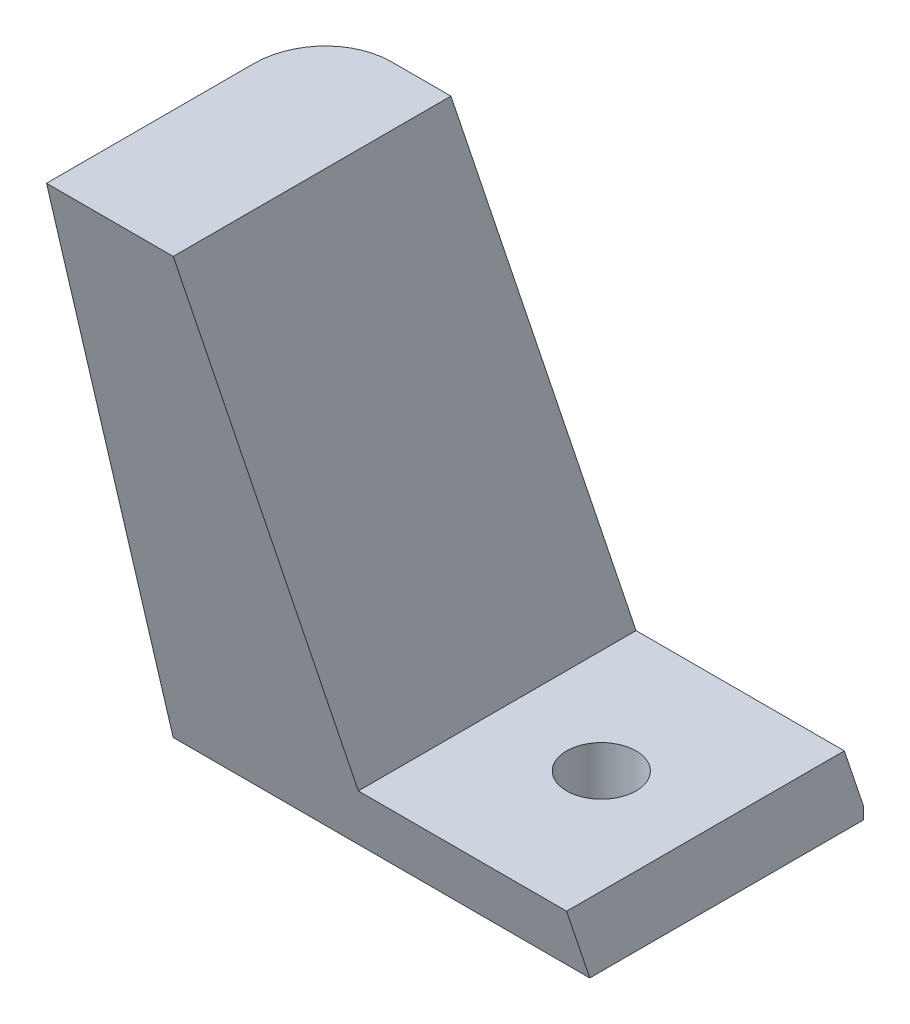
ISO-10303-21;
HEADER;
FILE_DESCRIPTION(('STEP AP214'),'2;1');
FILE_NAME('part.step','',(''),(''),'','','');
FILE_SCHEMA(('AUTOMOTIVE_DESIGN { 1 0 10303 214 1 1 1 1 }'));
ENDSEC;
DATA;
#1=APPLICATION_CONTEXT('core data for automotive mechanical design processes');
#2=APPLICATION_PROTOCOL_DEFINITION('international standard','automotive_design',2000,#1);
#3=PRODUCT_CONTEXT('',#1,'mechanical');
#4=PRODUCT('Part','Part','',(#3));
#5=PRODUCT_RELATED_PRODUCT_CATEGORY('part','',(#4));
#6=PRODUCT_DEFINITION_FORMATION('','',#4);
#7=PRODUCT_DEFINITION_CONTEXT('part definition',#1,'design');
#8=PRODUCT_DEFINITION('design','',#6,#7);
#9=PRODUCT_DEFINITION_SHAPE('','',#8);
#10=(LENGTH_UNIT() NAMED_UNIT(*) SI_UNIT(.MILLI.,.METRE.));
#11=(NAMED_UNIT(*) PLANE_ANGLE_UNIT() SI_UNIT($,.RADIAN.));
#12=(NAMED_UNIT(*) SI_UNIT($,.STERADIAN.) SOLID_ANGLE_UNIT());
#13=UNCERTAINTY_MEASURE_WITH_UNIT(LENGTH_MEASURE(1.E-05),#10,'distance_accuracy_value','');
#14=(GEOMETRIC_REPRESENTATION_CONTEXT(3) GLOBAL_UNCERTAINTY_ASSIGNED_CONTEXT((#13)) GLOBAL_UNIT_ASSIGNED_CONTEXT((#10,
#11,#12)) REPRESENTATION_CONTEXT('',''));
#15=CARTESIAN_POINT('',(0.,0.,0.));
#16=DIRECTION('',(0.,0.,1.));
#17=DIRECTION('',(1.,0.,0.));
#18=AXIS2_PLACEMENT_3D('',#15,#16,#17);
#19=CARTESIAN_POINT('',(-38.5237942591553,10.9820979896533,-41.357807884124));
#20=DIRECTION('',(0.122916675240222,0.941489427371917,0.313829809123972));
#21=DIRECTION('',(0.,-0.316227766016838,0.948683298050514));
#22=AXIS2_PLACEMENT_3D('',#19,#20,#21);
#23=CYLINDRICAL_SURFACE('',#22,5.);
#24=DIRECTION('',(0.122916675240222,0.941489427371917,0.313829809123973));
#25=VECTOR('',#24,1.);
#26=CARTESIAN_POINT('',(-38.5237942591553,12.5632368197375,-46.1012243743766));
#27=LINE('',#26,#25);
#28=CARTESIAN_POINT('',(-40.0508147125244,0.866909942867334,-50.));
#29=VERTEX_POINT('',#28);
#30=CARTESIAN_POINT('',(-34.2889946217321,45.,-35.2889699809558));
#31=VERTEX_POINT('',#30);
#32=EDGE_CURVE('E152',#29,#31,#27,.T.);
#33=ORIENTED_EDGE('',*,*,#32,.F.);
#34=CARTESIAN_POINT('',(-41.9086528378733,-14.9444783579746,-50.));
#35=DIRECTION('',(0.,0.,1.));
#36=DIRECTION('',(0.12945693643977,0.991585045070583,0.));
#37=AXIS2_PLACEMENT_3D('',#34,#35,#36);
#38=ELLIPSE('',#37,15.9322022785441,5.);
#39=CARTESIAN_POINT('',(-41.7980209043926,0.,-50.));
#40=VERTEX_POINT('',#39);
#41=EDGE_CURVE('E43',#40,#29,#38,.F.);
#42=ORIENTED_EDGE('',*,*,#41,.F.);
#43=CARTESIAN_POINT('',(-39.95756816336,0.,-45.0185072140085));
#44=DIRECTION('',(0.,-1.,0.));
#45=DIRECTION('',(0.364691898216784,0.,0.931128250766262));
#46=AXIS2_PLACEMENT_3D('',#43,#44,#45);
#47=ELLIPSE('',#46,5.31073409284802,5.);
#48=CARTESIAN_POINT('',(-45.,0.,-45.2342687747414));
#49=VERTEX_POINT('',#48);
#50=EDGE_CURVE('E53',#49,#40,#47,.T.);
#51=ORIENTED_EDGE('',*,*,#50,.F.);
#52=DIRECTION('',(0.122916675240222,0.941489427371918,0.313829809123973));
#53=VECTOR('',#52,1.);
#54=CARTESIAN_POINT('',(-44.5039547778212,3.79949531881639,-43.967770335136));
#55=LINE('',#54,#53);
#56=CARTESIAN_POINT('',(-39.125,45.,-30.2342687747414));
#57=VERTEX_POINT('',#56);
#58=EDGE_CURVE('E155',#57,#49,#55,.F.);
#59=ORIENTED_EDGE('',*,*,#58,.F.);
#60=CARTESIAN_POINT('',(-34.08256816336,45.,-30.0185072140085));
#61=DIRECTION('',(0.,-1.,0.));
#62=DIRECTION('',(0.364691898216784,0.,0.931128250766262));
#63=AXIS2_PLACEMENT_3D('',#60,#61,#62);
#64=ELLIPSE('',#63,5.31073409284802,5.);
#65=EDGE_CURVE('E11',#31,#57,#64,.F.);
#66=ORIENTED_EDGE('',*,*,#65,.F.);
#67=EDGE_LOOP('',(#33,#42,#51,#59,#66));
#68=FACE_BOUND('',#67,.T.);
#69=ADVANCED_FACE('F36',(#68),#23,.T.);
#70=CARTESIAN_POINT('',(0.,45.,-50.));
#71=DIRECTION('',(0.,-1.,0.));
#72=DIRECTION('',(0.,0.,-1.));
#73=AXIS2_PLACEMENT_3D('',#70,#71,#72);
#74=PLANE('',#73);
#75=DIRECTION('',(1.,0.,0.));
#76=VECTOR('',#75,1.);
#77=CARTESIAN_POINT('',(-60.,45.,-35.2889699809558));
#78=LINE('',#77,#76);
#79=CARTESIAN_POINT('',(-30.,45.,-35.2889699809558));
#80=VERTEX_POINT('',#79);
#81=EDGE_CURVE('E170',#31,#80,#78,.T.);
#82=ORIENTED_EDGE('',*,*,#81,.F.);
#83=ORIENTED_EDGE('',*,*,#65,.T.);
#84=DIRECTION('',(0.,0.,1.));
#85=VECTOR('',#84,1.);
#86=CARTESIAN_POINT('',(-39.125,45.,-50.));
#87=LINE('',#86,#85);
#88=CARTESIAN_POINT('',(-39.125,45.,-15.2932885193357));
#89=VERTEX_POINT('',#88);
#90=EDGE_CURVE('E105',#57,#89,#87,.T.);
#91=ORIENTED_EDGE('',*,*,#90,.T.);
#92=DIRECTION('',(1.,0.,0.));
#93=VECTOR('',#92,1.);
#94=CARTESIAN_POINT('',(-60.,45.,-15.2932885193357));
#95=LINE('',#94,#93);
#96=CARTESIAN_POINT('',(-30.,45.,-15.2932885193357));
#97=VERTEX_POINT('',#96);
#98=EDGE_CURVE('E136',#89,#97,#95,.T.);
#99=ORIENTED_EDGE('',*,*,#98,.T.);
#100=DIRECTION('',(0.,0.,1.));
#101=VECTOR('',#100,1.);
#102=CARTESIAN_POINT('',(-30.,45.,-50.));
#103=LINE('',#102,#101);
#104=EDGE_CURVE('E161',#80,#97,#103,.T.);
#105=ORIENTED_EDGE('',*,*,#104,.F.);
#106=EDGE_LOOP('',(#82,#83,#91,#99,#105));
#107=FACE_BOUND('',#106,.T.);
#108=ADVANCED_FACE('F183',(#107),#74,.F.);
#109=CARTESIAN_POINT('',(-30.,0.,-50.));
#110=DIRECTION('',(1.,0.,0.));
#111=DIRECTION('',(0.,0.,-1.));
#112=AXIS2_PLACEMENT_3D('',#109,#110,#111);
#113=PLANE('',#112);
#114=DIRECTION('',(0.,0.,1.));
#115=VECTOR('',#114,1.);
#116=CARTESIAN_POINT('',(-30.,5.00000000005107,-48.6223033142721));
#117=LINE('',#116,#115);
#118=CARTESIAN_POINT('',(-30.,5.00000000005107,-48.6223033142721));
#119=VERTEX_POINT('',#118);
#120=CARTESIAN_POINT('',(-30.,5.00000000005106,-28.6227831518699));
#121=VERTEX_POINT('',#120);
#122=EDGE_CURVE('E121',#119,#121,#117,.T.);
#123=ORIENTED_EDGE('',*,*,#122,.F.);
#124=DIRECTION('',(0.,0.948683298050514,0.316227766016838));
#125=VECTOR('',#124,1.);
#126=CARTESIAN_POINT('',(-30.,0.0866909942867335,-50.2600729828602));
#127=LINE('',#126,#125);
#128=EDGE_CURVE('E106',#119,#80,#127,.T.);
#129=ORIENTED_EDGE('',*,*,#128,.T.);
#130=ORIENTED_EDGE('',*,*,#104,.T.);
#131=DIRECTION('',(0.,0.948710608132915,0.316145823973803));
#132=VECTOR('',#131,1.);
#133=CARTESIAN_POINT('',(-30.,-5.91194691284608,-32.2590515970235));
#134=LINE('',#133,#132);
#135=EDGE_CURVE('E168',#121,#97,#134,.T.);
#136=ORIENTED_EDGE('',*,*,#135,.F.);
#137=EDGE_LOOP('',(#123,#129,#130,#136));
#138=FACE_BOUND('',#137,.T.);
#139=ADVANCED_FACE('F189',(#138),#113,.T.);
#140=CARTESIAN_POINT('',(-44.2458405723433,5.77654029694479,-50.));
#141=DIRECTION('',(-0.991585045070583,0.12945693643977,0.));
#142=DIRECTION('',(-0.12945693643977,-0.991585045070583,0.));
#143=AXIS2_PLACEMENT_3D('',#140,#141,#142);
#144=PLANE('',#143);
#145=ORIENTED_EDGE('',*,*,#90,.F.);
#146=ORIENTED_EDGE('',*,*,#58,.T.);
#147=DIRECTION('',(0.,0.,1.));
#148=VECTOR('',#147,1.);
#149=CARTESIAN_POINT('',(-45.,0.,-50.));
#150=LINE('',#149,#148);
#151=CARTESIAN_POINT('',(-45.,0.,-30.2889699809558));
#152=VERTEX_POINT('',#151);
#153=EDGE_CURVE('E164',#49,#152,#150,.T.);
#154=ORIENTED_EDGE('',*,*,#153,.T.);
#155=DIRECTION('',(-0.122920160223209,-0.94151612085863,-0.313748351986139));
#156=VECTOR('',#155,1.);
#157=CARTESIAN_POINT('',(-45.0802540777799,-0.614712085122489,-30.4938150169359));
#158=LINE('',#157,#156);
#159=EDGE_CURVE('E171',#89,#152,#158,.T.);
#160=ORIENTED_EDGE('',*,*,#159,.F.);
#161=EDGE_LOOP('',(#145,#146,#154,#160));
#162=FACE_BOUND('',#161,.T.);
#163=ADVANCED_FACE('F187',(#162),#144,.T.);
#164=CARTESIAN_POINT('',(0.,0.,-50.));
#165=DIRECTION('',(0.,0.,1.));
#166=DIRECTION('',(1.,0.,0.));
#167=AXIS2_PLACEMENT_3D('',#164,#165,#166);
#168=PLANE('',#167);
#169=DIRECTION('',(1.,0.,0.));
#170=VECTOR('',#169,1.);
#171=CARTESIAN_POINT('',(0.,0.,-50.));
#172=LINE('',#171,#170);
#173=CARTESIAN_POINT('',(-15.,0.,-50.));
#174=VERTEX_POINT('',#173);
#175=EDGE_CURVE('E97',#40,#174,#172,.T.);
#176=ORIENTED_EDGE('',*,*,#175,.F.);
#177=ORIENTED_EDGE('',*,*,#41,.T.);
#178=DIRECTION('',(-1.,0.,0.));
#179=VECTOR('',#178,1.);
#180=CARTESIAN_POINT('',(0.,0.866909942867334,-50.));
#181=LINE('',#180,#179);
#182=CARTESIAN_POINT('',(-15.,0.866909942867334,-50.));
#183=VERTEX_POINT('',#182);
#184=EDGE_CURVE('E112',#183,#29,#181,.T.);
#185=ORIENTED_EDGE('',*,*,#184,.F.);
#186=DIRECTION('',(0.,1.,0.));
#187=VECTOR('',#186,1.);
#188=CARTESIAN_POINT('',(-15.,0.,-50.));
#189=LINE('',#188,#187);
#190=EDGE_CURVE('E109',#174,#183,#189,.T.);
#191=ORIENTED_EDGE('',*,*,#190,.F.);
#192=EDGE_LOOP('',(#176,#177,#185,#191));
#193=FACE_BOUND('',#192,.T.);
#194=ADVANCED_FACE('F110',(#193),#168,.F.);
#195=CARTESIAN_POINT('',(0.,0.,-50.));
#196=DIRECTION('',(0.,-1.,0.));
#197=DIRECTION('',(1.,0.,0.));
#198=AXIS2_PLACEMENT_3D('',#195,#196,#197);
#199=PLANE('',#198);
#200=CARTESIAN_POINT('',(-22.5,0.,-38.622543233071));
#201=DIRECTION('',(0.,-1.,0.));
#202=DIRECTION('',(1.,0.,0.));
#203=AXIS2_PLACEMENT_3D('',#200,#201,#202);
#204=CIRCLE('',#203,2.50000000000127);
#205=CARTESIAN_POINT('',(-19.9999999999987,0.,-38.622543233071));
#206=VERTEX_POINT('',#205);
#207=EDGE_CURVE('E124',#206,#206,#204,.T.);
#208=ORIENTED_EDGE('',*,*,#207,.F.);
#209=EDGE_LOOP('',(#208));
#210=FACE_BOUND('',#209,.T.);
#211=ORIENTED_EDGE('',*,*,#153,.F.);
#212=ORIENTED_EDGE('',*,*,#50,.T.);
#213=ORIENTED_EDGE('',*,*,#175,.T.);
#214=DIRECTION('',(0.,8.97279949743536E-12,-1.));
#215=VECTOR('',#214,1.);
#216=CARTESIAN_POINT('',(-15.,-1.76865466716691E-10,-30.2889699810147));
#217=LINE('',#216,#215);
#218=CARTESIAN_POINT('',(-15.,-1.76865466716691E-10,-30.2889699810147));
#219=VERTEX_POINT('',#218);
#220=EDGE_CURVE('E103',#219,#174,#217,.T.);
#221=ORIENTED_EDGE('',*,*,#220,.F.);
#222=DIRECTION('',(1.,0.,0.));
#223=VECTOR('',#222,1.);
#224=CARTESIAN_POINT('',(-60.,-1.76865466716691E-10,-30.2889699810147));
#225=LINE('',#224,#223);
#226=EDGE_CURVE('E149',#152,#219,#225,.T.);
#227=ORIENTED_EDGE('',*,*,#226,.F.);
#228=EDGE_LOOP('',(#211,#212,#213,#221,#227));
#229=FACE_BOUND('',#228,.T.);
#230=ADVANCED_FACE('F100',(#210,#229),#199,.T.);
#231=CARTESIAN_POINT('',(-60.,15.0866909942867,-45.2600729828602));
#232=DIRECTION('',(0.,0.316227766016838,-0.948683298050514));
#233=DIRECTION('',(0.,0.948683298050514,0.316227766016838));
#234=AXIS2_PLACEMENT_3D('',#231,#232,#233);
#235=PLANE('',#234);
#236=ORIENTED_EDGE('',*,*,#184,.T.);
#237=ORIENTED_EDGE('',*,*,#32,.T.);
#238=ORIENTED_EDGE('',*,*,#81,.T.);
#239=ORIENTED_EDGE('',*,*,#128,.F.);
#240=DIRECTION('',(-1.,0.,0.));
#241=VECTOR('',#240,1.);
#242=CARTESIAN_POINT('',(-15.,5.00000000005107,-48.6223033142721));
#243=LINE('',#242,#241);
#244=CARTESIAN_POINT('',(-15.,5.00000000005107,-48.6223033142721));
#245=VERTEX_POINT('',#244);
#246=EDGE_CURVE('E144',#245,#119,#243,.T.);
#247=ORIENTED_EDGE('',*,*,#246,.F.);
#248=DIRECTION('',(0.,0.948683298050514,0.316227766016838));
#249=VECTOR('',#248,1.);
#250=CARTESIAN_POINT('',(-15.,0.866909942867334,-50.));
#251=LINE('',#250,#249);
#252=EDGE_CURVE('E115',#183,#245,#251,.T.);
#253=ORIENTED_EDGE('',*,*,#252,.F.);
#254=EDGE_LOOP('',(#236,#237,#238,#239,#247,#253));
#255=FACE_BOUND('',#254,.T.);
#256=ADVANCED_FACE('F159',(#255),#235,.T.);
#257=CARTESIAN_POINT('',(-60.,9.08459793319732,-27.2616424962198));
#258=DIRECTION('',(0.,0.316145823973803,-0.948710608132915));
#259=DIRECTION('',(0.,0.948710608132915,0.316145823973803));
#260=AXIS2_PLACEMENT_3D('',#257,#258,#259);
#261=PLANE('',#260);
#262=ORIENTED_EDGE('',*,*,#226,.T.);
#263=DIRECTION('',(0.,-0.948710608132915,-0.316145823973803));
#264=VECTOR('',#263,1.);
#265=CARTESIAN_POINT('',(-15.,5.00000000005106,-28.6227831518699));
#266=LINE('',#265,#264);
#267=CARTESIAN_POINT('',(-15.,5.00000000005106,-28.6227831518699));
#268=VERTEX_POINT('',#267);
#269=EDGE_CURVE('E120',#268,#219,#266,.T.);
#270=ORIENTED_EDGE('',*,*,#269,.F.);
#271=DIRECTION('',(-1.,0.,0.));
#272=VECTOR('',#271,1.);
#273=CARTESIAN_POINT('',(-15.,5.00000000005106,-28.6227831518699));
#274=LINE('',#273,#272);
#275=EDGE_CURVE('E133',#268,#121,#274,.T.);
#276=ORIENTED_EDGE('',*,*,#275,.T.);
#277=ORIENTED_EDGE('',*,*,#135,.T.);
#278=ORIENTED_EDGE('',*,*,#98,.F.);
#279=ORIENTED_EDGE('',*,*,#159,.T.);
#280=EDGE_LOOP('',(#262,#270,#276,#277,#278,#279));
#281=FACE_BOUND('',#280,.T.);
#282=ADVANCED_FACE('F186',(#281),#261,.F.);
#283=CARTESIAN_POINT('',(-15.,5.00000000005107,-48.6223033142721));
#284=DIRECTION('',(0.,-1.,0.));
#285=DIRECTION('',(0.,0.,-1.));
#286=AXIS2_PLACEMENT_3D('',#283,#284,#285);
#287=PLANE('',#286);
#288=CARTESIAN_POINT('',(-22.5,5.00000000005107,-38.622543233071));
#289=DIRECTION('',(0.,1.,0.));
#290=DIRECTION('',(0.,0.,1.));
#291=AXIS2_PLACEMENT_3D('',#288,#289,#290);
#292=CIRCLE('',#291,2.50000000000127);
#293=CARTESIAN_POINT('',(-22.5,5.00000000005107,-36.1225432330697));
#294=VERTEX_POINT('',#293);
#295=EDGE_CURVE('E266',#294,#294,#292,.T.);
#296=ORIENTED_EDGE('',*,*,#295,.F.);
#297=EDGE_LOOP('',(#296));
#298=FACE_BOUND('',#297,.T.);
#299=ORIENTED_EDGE('',*,*,#122,.T.);
#300=ORIENTED_EDGE('',*,*,#275,.F.);
#301=DIRECTION('',(0.,0.,1.));
#302=VECTOR('',#301,1.);
#303=CARTESIAN_POINT('',(-15.,5.00000000005107,-48.6223033142721));
#304=LINE('',#303,#302);
#305=EDGE_CURVE('E130',#245,#268,#304,.T.);
#306=ORIENTED_EDGE('',*,*,#305,.F.);
#307=ORIENTED_EDGE('',*,*,#246,.T.);
#308=EDGE_LOOP('',(#299,#300,#306,#307));
#309=FACE_BOUND('',#308,.T.);
#310=ADVANCED_FACE('F220',(#298,#309),#287,.F.);
#311=CARTESIAN_POINT('',(-15.,0.,0.));
#312=DIRECTION('',(1.,0.,0.));
#313=DIRECTION('',(0.,0.,-1.));
#314=AXIS2_PLACEMENT_3D('',#311,#312,#313);
#315=PLANE('',#314);
#316=ORIENTED_EDGE('',*,*,#220,.T.);
#317=ORIENTED_EDGE('',*,*,#190,.T.);
#318=ORIENTED_EDGE('',*,*,#252,.T.);
#319=ORIENTED_EDGE('',*,*,#305,.T.);
#320=ORIENTED_EDGE('',*,*,#269,.T.);
#321=EDGE_LOOP('',(#316,#317,#318,#319,#320));
#322=FACE_BOUND('',#321,.T.);
#323=ADVANCED_FACE('F118',(#322),#315,.T.);
#324=CARTESIAN_POINT('',(-22.5,-9.99999999994893,-38.622543233071));
#325=DIRECTION('',(0.,1.,0.));
#326=DIRECTION('',(0.,0.,1.));
#327=AXIS2_PLACEMENT_3D('',#324,#325,#326);
#328=CYLINDRICAL_SURFACE('',#327,2.50000000000127);
#329=ORIENTED_EDGE('',*,*,#207,.T.);
#330=EDGE_LOOP('',(#329));
#331=FACE_BOUND('',#330,.T.);
#332=ORIENTED_EDGE('',*,*,#295,.T.);
#333=EDGE_LOOP('',(#332));
#334=FACE_BOUND('',#333,.T.);
#335=ADVANCED_FACE('F234',(#331,#334),#328,.F.);
#336=CLOSED_SHELL('',(#69,#108,#139,#163,#194,#230,#256,#282,#310,#323,#335));
#337=MANIFOLD_SOLID_BREP('B2',#336);
#338=ADVANCED_BREP_SHAPE_REPRESENTATION('',(#18,#337),#14);
#339=SHAPE_DEFINITION_REPRESENTATION(#9,#338);
ENDSEC;
END-ISO-10303-21;
